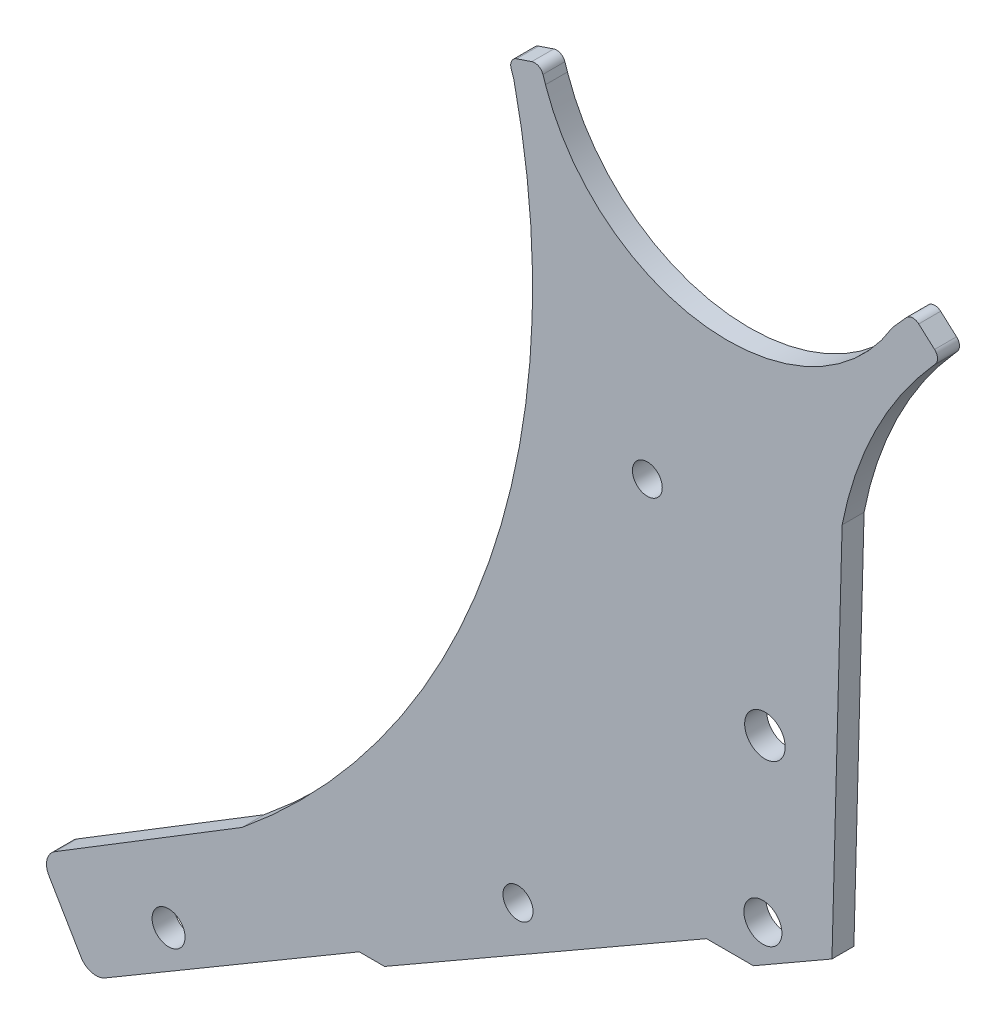
ISO-10303-21;
HEADER;
FILE_DESCRIPTION(('STEP AP214'),'2;1');
FILE_NAME('part.step','',(''),(''),'','','');
FILE_SCHEMA(('AUTOMOTIVE_DESIGN { 1 0 10303 214 1 1 1 1 }'));
ENDSEC;
DATA;
#1=APPLICATION_CONTEXT('core data for automotive mechanical design processes');
#2=APPLICATION_PROTOCOL_DEFINITION('international standard','automotive_design',2000,#1);
#3=PRODUCT_CONTEXT('',#1,'mechanical');
#4=PRODUCT('Part','Part','',(#3));
#5=PRODUCT_RELATED_PRODUCT_CATEGORY('part','',(#4));
#6=PRODUCT_DEFINITION_FORMATION('','',#4);
#7=PRODUCT_DEFINITION_CONTEXT('part definition',#1,'design');
#8=PRODUCT_DEFINITION('design','',#6,#7);
#9=PRODUCT_DEFINITION_SHAPE('','',#8);
#10=(LENGTH_UNIT() NAMED_UNIT(*) SI_UNIT(.MILLI.,.METRE.));
#11=(NAMED_UNIT(*) PLANE_ANGLE_UNIT() SI_UNIT($,.RADIAN.));
#12=(NAMED_UNIT(*) SI_UNIT($,.STERADIAN.) SOLID_ANGLE_UNIT());
#13=UNCERTAINTY_MEASURE_WITH_UNIT(LENGTH_MEASURE(1.E-05),#10,'distance_accuracy_value','');
#14=(GEOMETRIC_REPRESENTATION_CONTEXT(3) GLOBAL_UNCERTAINTY_ASSIGNED_CONTEXT((#13)) GLOBAL_UNIT_ASSIGNED_CONTEXT((#10,
#11,#12)) REPRESENTATION_CONTEXT('',''));
#15=CARTESIAN_POINT('',(0.,0.,0.));
#16=DIRECTION('',(0.,0.,1.));
#17=DIRECTION('',(1.,0.,0.));
#18=AXIS2_PLACEMENT_3D('',#15,#16,#17);
#19=CARTESIAN_POINT('',(3159.04794659915,4944.90162358502,25.));
#20=DIRECTION('',(0.,0.,-1.));
#21=DIRECTION('',(-1.,0.,0.));
#22=AXIS2_PLACEMENT_3D('',#19,#20,#21);
#23=PLANE('',#22);
#24=DIRECTION('',(0.867004066444502,0.49830106237966,0.));
#25=VECTOR('',#24,1.);
#26=CARTESIAN_POINT('',(2208.43093066674,4332.10493742993,25.));
#27=LINE('',#26,#25);
#28=CARTESIAN_POINT('',(2208.43093066674,4332.10493742993,25.));
#29=VERTEX_POINT('',#28);
#30=CARTESIAN_POINT('',(2574.93863669771,4542.75121505873,25.));
#31=VERTEX_POINT('',#30);
#32=EDGE_CURVE('E264',#29,#31,#27,.T.);
#33=ORIENTED_EDGE('',*,*,#32,.T.);
#34=DIRECTION('',(1.,0.,0.));
#35=VECTOR('',#34,1.);
#36=CARTESIAN_POINT('',(2574.93863669771,4542.75121505873,25.));
#37=LINE('',#36,#35);
#38=CARTESIAN_POINT('',(2628.39459834182,4542.75121505873,25.));
#39=VERTEX_POINT('',#38);
#40=EDGE_CURVE('E137',#31,#39,#37,.T.);
#41=ORIENTED_EDGE('',*,*,#40,.T.);
#42=DIRECTION('',(0.867004066444504,0.498301062379657,0.));
#43=VECTOR('',#42,1.);
#44=CARTESIAN_POINT('',(2628.39459834182,4542.75121505873,25.));
#45=LINE('',#44,#43);
#46=CARTESIAN_POINT('',(2717.83873943808,4594.15825253052,25.));
#47=VERTEX_POINT('',#46);
#48=EDGE_CURVE('E324',#39,#47,#45,.T.);
#49=ORIENTED_EDGE('',*,*,#48,.T.);
#50=DIRECTION('',(0.0267107411816373,0.99964320450125,0.));
#51=VECTOR('',#50,1.);
#52=CARTESIAN_POINT('',(2717.83873943808,4594.15825253052,25.));
#53=LINE('',#52,#51);
#54=CARTESIAN_POINT('',(2729.43156154605,5028.01689248414,25.));
#55=VERTEX_POINT('',#54);
#56=EDGE_CURVE('E343',#47,#55,#53,.T.);
#57=ORIENTED_EDGE('',*,*,#56,.T.);
#58=CARTESIAN_POINT('',(3159.04794659915,4944.90162358502,25.));
#59=DIRECTION('',(0.,0.,-1.));
#60=DIRECTION('',(-1.,0.,0.));
#61=AXIS2_PLACEMENT_3D('',#58,#59,#60);
#62=CIRCLE('',#61,437.582433639961);
#63=CARTESIAN_POINT('',(2832.53437686692,5236.2215079235,25.));
#64=VERTEX_POINT('',#63);
#65=EDGE_CURVE('E340',#55,#64,#62,.T.);
#66=ORIENTED_EDGE('',*,*,#65,.T.);
#67=DIRECTION('',(0.665748581164999,0.746176136496465,0.));
#68=VECTOR('',#67,1.);
#69=CARTESIAN_POINT('',(2832.53437686692,5236.2215079235,25.));
#70=LINE('',#69,#68);
#71=CARTESIAN_POINT('',(2835.47693860174,5239.51955377563,25.));
#72=VERTEX_POINT('',#71);
#73=EDGE_CURVE('E342',#64,#72,#70,.T.);
#74=ORIENTED_EDGE('',*,*,#73,.T.);
#75=CARTESIAN_POINT('',(2828.01517723675,5246.17703958726,25.));
#76=DIRECTION('',(0.,0.,1.));
#77=DIRECTION('',(1.,0.,0.));
#78=AXIS2_PLACEMENT_3D('',#75,#76,#77);
#79=CIRCLE('',#78,10.0000000000113);
#80=CARTESIAN_POINT('',(2834.67266304841,5253.63880095225,25.));
#81=VERTEX_POINT('',#80);
#82=EDGE_CURVE('E345',#72,#81,#79,.T.);
#83=ORIENTED_EDGE('',*,*,#82,.T.);
#84=DIRECTION('',(-0.746176136496549,0.665748581164904,0.));
#85=VECTOR('',#84,1.);
#86=CARTESIAN_POINT('',(2834.67266304841,5253.63880095225,25.));
#87=LINE('',#86,#85);
#88=CARTESIAN_POINT('',(2816.61377570219,5269.7511878809,25.));
#89=VERTEX_POINT('',#88);
#90=EDGE_CURVE('E351',#81,#89,#87,.T.);
#91=ORIENTED_EDGE('',*,*,#90,.T.);
#92=CARTESIAN_POINT('',(2809.95628989053,5262.28942651591,25.));
#93=DIRECTION('',(0.,0.,1.));
#94=DIRECTION('',(1.,0.,0.));
#95=AXIS2_PLACEMENT_3D('',#92,#93,#94);
#96=CIRCLE('',#95,10.0000000000235);
#97=CARTESIAN_POINT('',(2802.49452852558,5268.94691232759,25.));
#98=VERTEX_POINT('',#97);
#99=EDGE_CURVE('E353',#89,#98,#96,.T.);
#100=ORIENTED_EDGE('',*,*,#99,.T.);
#101=DIRECTION('',(-0.66574858116492,-0.746176136496535,0.));
#102=VECTOR('',#101,1.);
#103=CARTESIAN_POINT('',(2802.49452852558,5268.94691232759,25.));
#104=LINE('',#103,#102);
#105=CARTESIAN_POINT('',(2786.8013182789,5251.35784143449,25.));
#106=VERTEX_POINT('',#105);
#107=EDGE_CURVE('E355',#98,#106,#104,.T.);
#108=ORIENTED_EDGE('',*,*,#107,.T.);
#109=CARTESIAN_POINT('',(2598.8786965237,5363.26143505457,25.));
#110=DIRECTION('',(0.,0.,-1.));
#111=DIRECTION('',(-1.,0.,0.));
#112=AXIS2_PLACEMENT_3D('',#109,#110,#111);
#113=CIRCLE('',#112,218.717457082036);
#114=CARTESIAN_POINT('',(2391.6847836824,5293.20425473778,25.));
#115=VERTEX_POINT('',#114);
#116=EDGE_CURVE('E357',#106,#115,#113,.T.);
#117=ORIENTED_EDGE('',*,*,#116,.T.);
#118=DIRECTION('',(-0.320309047350232,0.94731310250919,0.));
#119=VECTOR('',#118,1.);
#120=CARTESIAN_POINT('',(2391.6847836824,5293.20425473778,25.));
#121=LINE('',#120,#119);
#122=CARTESIAN_POINT('',(2388.75367878607,5301.87298918688,25.));
#123=VERTEX_POINT('',#122);
#124=EDGE_CURVE('E359',#115,#123,#121,.T.);
#125=ORIENTED_EDGE('',*,*,#124,.T.);
#126=CARTESIAN_POINT('',(2379.28054776096,5298.66989871334,25.));
#127=DIRECTION('',(0.,0.,1.));
#128=DIRECTION('',(1.,0.,0.));
#129=AXIS2_PLACEMENT_3D('',#126,#127,#128);
#130=CIRCLE('',#129,10.0000000000312);
#131=CARTESIAN_POINT('',(2376.07745728748,5308.14302973847,25.));
#132=VERTEX_POINT('',#131);
#133=EDGE_CURVE('E361',#123,#132,#130,.T.);
#134=ORIENTED_EDGE('',*,*,#133,.T.);
#135=DIRECTION('',(-0.947313102509187,-0.32030904735024,0.));
#136=VECTOR('',#135,1.);
#137=CARTESIAN_POINT('',(2376.07745728748,5308.14302973847,25.));
#138=LINE('',#137,#136);
#139=CARTESIAN_POINT('',(2358.86126291214,5302.32182574078,25.));
#140=VERTEX_POINT('',#139);
#141=EDGE_CURVE('E363',#132,#140,#138,.T.);
#142=ORIENTED_EDGE('',*,*,#141,.T.);
#143=CARTESIAN_POINT('',(2362.06435338562,5292.84869471568,25.));
#144=DIRECTION('',(0.,0.,1.));
#145=DIRECTION('',(1.,0.,0.));
#146=AXIS2_PLACEMENT_3D('',#143,#144,#145);
#147=CIRCLE('',#146,10.0000000000024);
#148=CARTESIAN_POINT('',(2352.59122236054,5289.64560424222,25.));
#149=VERTEX_POINT('',#148);
#150=EDGE_CURVE('E365',#140,#149,#147,.T.);
#151=ORIENTED_EDGE('',*,*,#150,.T.);
#152=DIRECTION('',(0.320309047350246,-0.947313102509185,0.));
#153=VECTOR('',#152,1.);
#154=CARTESIAN_POINT('',(2352.59122236054,5289.64560424222,25.));
#155=LINE('',#154,#153);
#156=CARTESIAN_POINT('',(2355.52232725686,5280.97686979311,25.));
#157=VERTEX_POINT('',#156);
#158=EDGE_CURVE('E367',#149,#157,#155,.T.);
#159=ORIENTED_EDGE('',*,*,#158,.T.);
#160=CARTESIAN_POINT('',(1476.62059618426,5085.42901884207,25.));
#161=DIRECTION('',(0.,0.,-1.));
#162=DIRECTION('',(1.,0.,0.));
#163=AXIS2_PLACEMENT_3D('',#160,#161,#162);
#164=CIRCLE('',#163,900.392811440648);
#165=CARTESIAN_POINT('',(2046.19183959997,4388.07988564704,25.));
#166=VERTEX_POINT('',#165);
#167=EDGE_CURVE('E369',#157,#166,#164,.T.);
#168=ORIENTED_EDGE('',*,*,#167,.T.);
#169=DIRECTION('',(-0.852942357097446,-0.522005110577524,0.));
#170=VECTOR('',#169,1.);
#171=CARTESIAN_POINT('',(1833.10841997078,4257.67173660836,25.));
#172=LINE('',#171,#170);
#173=CARTESIAN_POINT('',(1833.10841997078,4257.67173660836,25.));
#174=VERTEX_POINT('',#173);
#175=EDGE_CURVE('E371',#166,#174,#172,.T.);
#176=ORIENTED_EDGE('',*,*,#175,.T.);
#177=CARTESIAN_POINT('',(1843.54852218233,4240.61288946641,25.));
#178=DIRECTION('',(0.,0.,1.));
#179=DIRECTION('',(-1.,0.,0.));
#180=AXIS2_PLACEMENT_3D('',#177,#178,#179);
#181=CIRCLE('',#180,20.0000000000001);
#182=CARTESIAN_POINT('',(1826.31583589167,4230.46229720745,25.));
#183=VERTEX_POINT('',#182);
#184=EDGE_CURVE('E373',#174,#183,#181,.T.);
#185=ORIENTED_EDGE('',*,*,#184,.T.);
#186=DIRECTION('',(0.507529612947959,-0.861634314533083,0.));
#187=VECTOR('',#186,1.);
#188=CARTESIAN_POINT('',(1862.71795105015,4168.6623337335,25.));
#189=LINE('',#188,#187);
#190=CARTESIAN_POINT('',(1862.71795105015,4168.6623337335,25.));
#191=VERTEX_POINT('',#190);
#192=EDGE_CURVE('E201',#183,#191,#189,.T.);
#193=ORIENTED_EDGE('',*,*,#192,.T.);
#194=CARTESIAN_POINT('',(1879.95063734081,4178.81292599246,25.));
#195=DIRECTION('',(0.,0.,1.));
#196=DIRECTION('',(1.,0.,0.));
#197=AXIS2_PLACEMENT_3D('',#194,#195,#196);
#198=CIRCLE('',#197,19.9999999999997);
#199=CARTESIAN_POINT('',(1890.10122959977,4161.58023970179,25.));
#200=VERTEX_POINT('',#199);
#201=EDGE_CURVE('E195',#191,#200,#198,.T.);
#202=ORIENTED_EDGE('',*,*,#201,.T.);
#203=DIRECTION('',(0.861634314533082,0.50752961294796,0.));
#204=VECTOR('',#203,1.);
#205=CARTESIAN_POINT('',(1890.10122959977,4161.58023970179,25.));
#206=LINE('',#205,#204);
#207=CARTESIAN_POINT('',(2179.6014425716,4332.10493742993,25.));
#208=VERTEX_POINT('',#207);
#209=EDGE_CURVE('E199',#200,#208,#206,.T.);
#210=ORIENTED_EDGE('',*,*,#209,.T.);
#211=DIRECTION('',(1.,0.,0.));
#212=VECTOR('',#211,1.);
#213=CARTESIAN_POINT('',(2179.6014425716,4332.10493742993,25.));
#214=LINE('',#213,#212);
#215=EDGE_CURVE('E49',#208,#29,#214,.T.);
#216=ORIENTED_EDGE('',*,*,#215,.T.);
#217=EDGE_LOOP('',(#33,#41,#49,#57,#66,#74,#83,#91,#100,#108,#117,#125,#134,#142,#151,#159,#168,
#176,#185,#193,#202,#210,#216));
#218=FACE_BOUND('',#217,.T.);
#219=CARTESIAN_POINT('',(1962.52950321667,4247.28244954385,25.));
#220=DIRECTION('',(0.,0.,1.));
#221=DIRECTION('',(1.,0.,0.));
#222=AXIS2_PLACEMENT_3D('',#219,#220,#221);
#223=CIRCLE('',#222,18.7853893391976);
#224=CARTESIAN_POINT('',(1981.31489255586,4247.28244954385,25.));
#225=VERTEX_POINT('',#224);
#226=EDGE_CURVE('E223',#225,#225,#223,.T.);
#227=ORIENTED_EDGE('',*,*,#226,.F.);
#228=EDGE_LOOP('',(#227));
#229=FACE_BOUND('',#228,.T.);
#230=CARTESIAN_POINT('',(2360.38808832887,4470.79330168986,25.));
#231=DIRECTION('',(0.,0.,1.));
#232=DIRECTION('',(1.,0.,0.));
#233=AXIS2_PLACEMENT_3D('',#230,#231,#232);
#234=CIRCLE('',#233,17.0932326128872);
#235=CARTESIAN_POINT('',(2377.48132094175,4470.79330168986,25.));
#236=VERTEX_POINT('',#235);
#237=EDGE_CURVE('E447',#236,#236,#234,.T.);
#238=ORIENTED_EDGE('',*,*,#237,.F.);
#239=EDGE_LOOP('',(#238));
#240=FACE_BOUND('',#239,.T.);
#241=CARTESIAN_POINT('',(2639.19466363185,4591.01574940001,25.));
#242=DIRECTION('',(0.,0.,1.));
#243=DIRECTION('',(1.,0.,0.));
#244=AXIS2_PLACEMENT_3D('',#241,#242,#243);
#245=CIRCLE('',#244,21.6482206468473);
#246=CARTESIAN_POINT('',(2660.8428842787,4591.01574940001,25.));
#247=VERTEX_POINT('',#246);
#248=EDGE_CURVE('E441',#247,#247,#245,.T.);
#249=ORIENTED_EDGE('',*,*,#248,.F.);
#250=EDGE_LOOP('',(#249));
#251=FACE_BOUND('',#250,.T.);
#252=CARTESIAN_POINT('',(2641.51524070192,4776.37987824989,25.));
#253=DIRECTION('',(0.,0.,1.));
#254=DIRECTION('',(1.,0.,0.));
#255=AXIS2_PLACEMENT_3D('',#252,#253,#254);
#256=CIRCLE('',#255,23.0850880798075);
#257=CARTESIAN_POINT('',(2664.60032878173,4776.37987824989,25.));
#258=VERTEX_POINT('',#257);
#259=EDGE_CURVE('E435',#258,#258,#256,.T.);
#260=ORIENTED_EDGE('',*,*,#259,.F.);
#261=EDGE_LOOP('',(#260));
#262=FACE_BOUND('',#261,.T.);
#263=CARTESIAN_POINT('',(2507.64090962262,4962.30334614338,25.));
#264=DIRECTION('',(0.,0.,1.));
#265=DIRECTION('',(1.,0.,0.));
#266=AXIS2_PLACEMENT_3D('',#263,#264,#265);
#267=CIRCLE('',#266,16.9907779611247);
#268=CARTESIAN_POINT('',(2524.63168758375,4962.30334614338,25.));
#269=VERTEX_POINT('',#268);
#270=EDGE_CURVE('E426',#269,#269,#267,.T.);
#271=ORIENTED_EDGE('',*,*,#270,.F.);
#272=EDGE_LOOP('',(#271));
#273=FACE_BOUND('',#272,.T.);
#274=ADVANCED_FACE('F32',(#218,#229,#240,#251,#262,#273),#23,.F.);
#275=CARTESIAN_POINT('',(3159.04794659915,4944.90162358502,0.));
#276=DIRECTION('',(0.,0.,-1.));
#277=DIRECTION('',(-1.,0.,0.));
#278=AXIS2_PLACEMENT_3D('',#275,#276,#277);
#279=PLANE('',#278);
#280=CARTESIAN_POINT('',(2641.51524070192,4776.37987824989,0.));
#281=DIRECTION('',(0.,0.,1.));
#282=DIRECTION('',(1.,0.,0.));
#283=AXIS2_PLACEMENT_3D('',#280,#281,#282);
#284=CIRCLE('',#283,23.0850880798075);
#285=CARTESIAN_POINT('',(2664.60032878173,4776.37987824989,0.));
#286=VERTEX_POINT('',#285);
#287=EDGE_CURVE('E432',#286,#286,#284,.T.);
#288=ORIENTED_EDGE('',*,*,#287,.T.);
#289=EDGE_LOOP('',(#288));
#290=FACE_BOUND('',#289,.T.);
#291=CARTESIAN_POINT('',(2360.38808832887,4470.79330168986,0.));
#292=DIRECTION('',(0.,0.,1.));
#293=DIRECTION('',(1.,0.,0.));
#294=AXIS2_PLACEMENT_3D('',#291,#292,#293);
#295=CIRCLE('',#294,17.0932326128872);
#296=CARTESIAN_POINT('',(2377.48132094175,4470.79330168986,0.));
#297=VERTEX_POINT('',#296);
#298=EDGE_CURVE('E444',#297,#297,#295,.T.);
#299=ORIENTED_EDGE('',*,*,#298,.T.);
#300=EDGE_LOOP('',(#299));
#301=FACE_BOUND('',#300,.T.);
#302=DIRECTION('',(0.867004066444502,0.49830106237966,0.));
#303=VECTOR('',#302,1.);
#304=CARTESIAN_POINT('',(2208.43093066674,4332.10493742993,0.));
#305=LINE('',#304,#303);
#306=CARTESIAN_POINT('',(2208.43093066674,4332.10493742993,0.));
#307=VERTEX_POINT('',#306);
#308=CARTESIAN_POINT('',(2574.93863669771,4542.75121505873,0.));
#309=VERTEX_POINT('',#308);
#310=EDGE_CURVE('E219',#307,#309,#305,.T.);
#311=ORIENTED_EDGE('',*,*,#310,.F.);
#312=DIRECTION('',(1.,0.,0.));
#313=VECTOR('',#312,1.);
#314=CARTESIAN_POINT('',(2179.6014425716,4332.10493742993,0.));
#315=LINE('',#314,#313);
#316=CARTESIAN_POINT('',(2179.6014425716,4332.10493742993,0.));
#317=VERTEX_POINT('',#316);
#318=EDGE_CURVE('E129',#317,#307,#315,.T.);
#319=ORIENTED_EDGE('',*,*,#318,.F.);
#320=DIRECTION('',(0.861634314533082,0.50752961294796,0.));
#321=VECTOR('',#320,1.);
#322=CARTESIAN_POINT('',(1890.10122959977,4161.58023970179,0.));
#323=LINE('',#322,#321);
#324=CARTESIAN_POINT('',(1890.10122959977,4161.58023970179,0.));
#325=VERTEX_POINT('',#324);
#326=EDGE_CURVE('E123',#325,#317,#323,.T.);
#327=ORIENTED_EDGE('',*,*,#326,.F.);
#328=CARTESIAN_POINT('',(1879.95063734081,4178.81292599246,0.));
#329=DIRECTION('',(0.,0.,1.));
#330=DIRECTION('',(1.,0.,0.));
#331=AXIS2_PLACEMENT_3D('',#328,#329,#330);
#332=CIRCLE('',#331,19.9999999999997);
#333=CARTESIAN_POINT('',(1862.71795105015,4168.6623337335,0.));
#334=VERTEX_POINT('',#333);
#335=EDGE_CURVE('E209',#334,#325,#332,.T.);
#336=ORIENTED_EDGE('',*,*,#335,.F.);
#337=DIRECTION('',(0.507529612947959,-0.861634314533083,0.));
#338=VECTOR('',#337,1.);
#339=CARTESIAN_POINT('',(1862.71795105015,4168.6623337335,0.));
#340=LINE('',#339,#338);
#341=CARTESIAN_POINT('',(1826.31583589167,4230.46229720745,0.));
#342=VERTEX_POINT('',#341);
#343=EDGE_CURVE('E259',#342,#334,#340,.T.);
#344=ORIENTED_EDGE('',*,*,#343,.F.);
#345=CARTESIAN_POINT('',(1843.54852218233,4240.61288946641,0.));
#346=DIRECTION('',(0.,0.,1.));
#347=DIRECTION('',(-1.,0.,0.));
#348=AXIS2_PLACEMENT_3D('',#345,#346,#347);
#349=CIRCLE('',#348,20.0000000000001);
#350=CARTESIAN_POINT('',(1833.10841997078,4257.67173660836,0.));
#351=VERTEX_POINT('',#350);
#352=EDGE_CURVE('E257',#351,#342,#349,.T.);
#353=ORIENTED_EDGE('',*,*,#352,.F.);
#354=DIRECTION('',(-0.852942357097446,-0.522005110577524,0.));
#355=VECTOR('',#354,1.);
#356=CARTESIAN_POINT('',(1833.10841997078,4257.67173660836,0.));
#357=LINE('',#356,#355);
#358=CARTESIAN_POINT('',(2046.19183959997,4388.07988564704,0.));
#359=VERTEX_POINT('',#358);
#360=EDGE_CURVE('E255',#359,#351,#357,.T.);
#361=ORIENTED_EDGE('',*,*,#360,.F.);
#362=CARTESIAN_POINT('',(1476.62059618426,5085.42901884207,0.));
#363=DIRECTION('',(0.,0.,-1.));
#364=DIRECTION('',(1.,0.,0.));
#365=AXIS2_PLACEMENT_3D('',#362,#363,#364);
#366=CIRCLE('',#365,900.392811440648);
#367=CARTESIAN_POINT('',(2355.52232725686,5280.97686979311,0.));
#368=VERTEX_POINT('',#367);
#369=EDGE_CURVE('E253',#368,#359,#366,.T.);
#370=ORIENTED_EDGE('',*,*,#369,.F.);
#371=DIRECTION('',(0.320309047350246,-0.947313102509185,0.));
#372=VECTOR('',#371,1.);
#373=CARTESIAN_POINT('',(2352.59122236054,5289.64560424222,0.));
#374=LINE('',#373,#372);
#375=CARTESIAN_POINT('',(2352.59122236054,5289.64560424222,0.));
#376=VERTEX_POINT('',#375);
#377=EDGE_CURVE('E251',#376,#368,#374,.T.);
#378=ORIENTED_EDGE('',*,*,#377,.F.);
#379=CARTESIAN_POINT('',(2362.06435338562,5292.84869471568,0.));
#380=DIRECTION('',(0.,0.,1.));
#381=DIRECTION('',(1.,0.,0.));
#382=AXIS2_PLACEMENT_3D('',#379,#380,#381);
#383=CIRCLE('',#382,10.0000000000024);
#384=CARTESIAN_POINT('',(2358.86126291214,5302.32182574078,0.));
#385=VERTEX_POINT('',#384);
#386=EDGE_CURVE('E249',#385,#376,#383,.T.);
#387=ORIENTED_EDGE('',*,*,#386,.F.);
#388=DIRECTION('',(-0.947313102509187,-0.32030904735024,0.));
#389=VECTOR('',#388,1.);
#390=CARTESIAN_POINT('',(2376.07745728748,5308.14302973847,0.));
#391=LINE('',#390,#389);
#392=CARTESIAN_POINT('',(2376.07745728748,5308.14302973847,0.));
#393=VERTEX_POINT('',#392);
#394=EDGE_CURVE('E247',#393,#385,#391,.T.);
#395=ORIENTED_EDGE('',*,*,#394,.F.);
#396=CARTESIAN_POINT('',(2379.28054776096,5298.66989871334,0.));
#397=DIRECTION('',(0.,0.,1.));
#398=DIRECTION('',(1.,0.,0.));
#399=AXIS2_PLACEMENT_3D('',#396,#397,#398);
#400=CIRCLE('',#399,10.0000000000312);
#401=CARTESIAN_POINT('',(2388.75367878607,5301.87298918688,0.));
#402=VERTEX_POINT('',#401);
#403=EDGE_CURVE('E245',#402,#393,#400,.T.);
#404=ORIENTED_EDGE('',*,*,#403,.F.);
#405=DIRECTION('',(-0.320309047350232,0.94731310250919,0.));
#406=VECTOR('',#405,1.);
#407=CARTESIAN_POINT('',(2391.6847836824,5293.20425473778,0.));
#408=LINE('',#407,#406);
#409=CARTESIAN_POINT('',(2391.6847836824,5293.20425473778,0.));
#410=VERTEX_POINT('',#409);
#411=EDGE_CURVE('E243',#410,#402,#408,.T.);
#412=ORIENTED_EDGE('',*,*,#411,.F.);
#413=CARTESIAN_POINT('',(2598.8786965237,5363.26143505457,0.));
#414=DIRECTION('',(0.,0.,-1.));
#415=DIRECTION('',(-1.,0.,0.));
#416=AXIS2_PLACEMENT_3D('',#413,#414,#415);
#417=CIRCLE('',#416,218.717457082036);
#418=CARTESIAN_POINT('',(2786.8013182789,5251.35784143449,0.));
#419=VERTEX_POINT('',#418);
#420=EDGE_CURVE('E241',#419,#410,#417,.T.);
#421=ORIENTED_EDGE('',*,*,#420,.F.);
#422=DIRECTION('',(-0.66574858116492,-0.746176136496535,0.));
#423=VECTOR('',#422,1.);
#424=CARTESIAN_POINT('',(2802.49452852558,5268.94691232759,0.));
#425=LINE('',#424,#423);
#426=CARTESIAN_POINT('',(2802.49452852558,5268.94691232759,0.));
#427=VERTEX_POINT('',#426);
#428=EDGE_CURVE('E239',#427,#419,#425,.T.);
#429=ORIENTED_EDGE('',*,*,#428,.F.);
#430=CARTESIAN_POINT('',(2809.95628989053,5262.28942651591,0.));
#431=DIRECTION('',(0.,0.,1.));
#432=DIRECTION('',(1.,0.,0.));
#433=AXIS2_PLACEMENT_3D('',#430,#431,#432);
#434=CIRCLE('',#433,10.0000000000235);
#435=CARTESIAN_POINT('',(2816.61377570219,5269.7511878809,0.));
#436=VERTEX_POINT('',#435);
#437=EDGE_CURVE('E237',#436,#427,#434,.T.);
#438=ORIENTED_EDGE('',*,*,#437,.F.);
#439=DIRECTION('',(-0.746176136496549,0.665748581164904,0.));
#440=VECTOR('',#439,1.);
#441=CARTESIAN_POINT('',(2834.67266304841,5253.63880095225,0.));
#442=LINE('',#441,#440);
#443=CARTESIAN_POINT('',(2834.67266304841,5253.63880095225,0.));
#444=VERTEX_POINT('',#443);
#445=EDGE_CURVE('E235',#444,#436,#442,.T.);
#446=ORIENTED_EDGE('',*,*,#445,.F.);
#447=CARTESIAN_POINT('',(2828.01517723675,5246.17703958726,0.));
#448=DIRECTION('',(0.,0.,1.));
#449=DIRECTION('',(1.,0.,0.));
#450=AXIS2_PLACEMENT_3D('',#447,#448,#449);
#451=CIRCLE('',#450,10.0000000000113);
#452=CARTESIAN_POINT('',(2835.47693860174,5239.51955377563,0.));
#453=VERTEX_POINT('',#452);
#454=EDGE_CURVE('E233',#453,#444,#451,.T.);
#455=ORIENTED_EDGE('',*,*,#454,.F.);
#456=DIRECTION('',(0.665748581164999,0.746176136496465,0.));
#457=VECTOR('',#456,1.);
#458=CARTESIAN_POINT('',(2832.53437686692,5236.2215079235,0.));
#459=LINE('',#458,#457);
#460=CARTESIAN_POINT('',(2832.53437686692,5236.2215079235,0.));
#461=VERTEX_POINT('',#460);
#462=EDGE_CURVE('E231',#461,#453,#459,.T.);
#463=ORIENTED_EDGE('',*,*,#462,.F.);
#464=CARTESIAN_POINT('',(3159.04794659915,4944.90162358502,0.));
#465=DIRECTION('',(0.,0.,-1.));
#466=DIRECTION('',(-1.,0.,0.));
#467=AXIS2_PLACEMENT_3D('',#464,#465,#466);
#468=CIRCLE('',#467,437.582433639961);
#469=CARTESIAN_POINT('',(2729.43156154605,5028.01689248414,0.));
#470=VERTEX_POINT('',#469);
#471=EDGE_CURVE('E229',#470,#461,#468,.T.);
#472=ORIENTED_EDGE('',*,*,#471,.F.);
#473=DIRECTION('',(0.0267107411816373,0.99964320450125,0.));
#474=VECTOR('',#473,1.);
#475=CARTESIAN_POINT('',(2717.83873943808,4594.15825253052,0.));
#476=LINE('',#475,#474);
#477=CARTESIAN_POINT('',(2717.83873943808,4594.15825253052,0.));
#478=VERTEX_POINT('',#477);
#479=EDGE_CURVE('E227',#478,#470,#476,.T.);
#480=ORIENTED_EDGE('',*,*,#479,.F.);
#481=DIRECTION('',(0.867004066444504,0.498301062379657,0.));
#482=VECTOR('',#481,1.);
#483=CARTESIAN_POINT('',(2628.39459834182,4542.75121505873,0.));
#484=LINE('',#483,#482);
#485=CARTESIAN_POINT('',(2628.39459834182,4542.75121505873,0.));
#486=VERTEX_POINT('',#485);
#487=EDGE_CURVE('E225',#486,#478,#484,.T.);
#488=ORIENTED_EDGE('',*,*,#487,.F.);
#489=DIRECTION('',(1.,0.,0.));
#490=VECTOR('',#489,1.);
#491=CARTESIAN_POINT('',(2574.93863669771,4542.75121505873,0.));
#492=LINE('',#491,#490);
#493=EDGE_CURVE('E222',#309,#486,#492,.T.);
#494=ORIENTED_EDGE('',*,*,#493,.F.);
#495=EDGE_LOOP('',(#311,#319,#327,#336,#344,#353,#361,#370,#378,#387,#395,#404,#412,#421,#429,
#438,#446,#455,#463,#472,#480,#488,#494));
#496=FACE_BOUND('',#495,.T.);
#497=CARTESIAN_POINT('',(1962.52950321667,4247.28244954385,0.));
#498=DIRECTION('',(0.,0.,1.));
#499=DIRECTION('',(1.,0.,0.));
#500=AXIS2_PLACEMENT_3D('',#497,#498,#499);
#501=CIRCLE('',#500,18.7853893391976);
#502=CARTESIAN_POINT('',(1981.31489255586,4247.28244954385,0.));
#503=VERTEX_POINT('',#502);
#504=EDGE_CURVE('E450',#503,#503,#501,.T.);
#505=ORIENTED_EDGE('',*,*,#504,.T.);
#506=EDGE_LOOP('',(#505));
#507=FACE_BOUND('',#506,.T.);
#508=CARTESIAN_POINT('',(2639.19466363185,4591.01574940001,0.));
#509=DIRECTION('',(0.,0.,1.));
#510=DIRECTION('',(1.,0.,0.));
#511=AXIS2_PLACEMENT_3D('',#508,#509,#510);
#512=CIRCLE('',#511,21.6482206468473);
#513=CARTESIAN_POINT('',(2660.8428842787,4591.01574940001,0.));
#514=VERTEX_POINT('',#513);
#515=EDGE_CURVE('E438',#514,#514,#512,.T.);
#516=ORIENTED_EDGE('',*,*,#515,.T.);
#517=EDGE_LOOP('',(#516));
#518=FACE_BOUND('',#517,.T.);
#519=CARTESIAN_POINT('',(2507.64090962262,4962.30334614338,0.));
#520=DIRECTION('',(0.,0.,1.));
#521=DIRECTION('',(1.,0.,0.));
#522=AXIS2_PLACEMENT_3D('',#519,#520,#521);
#523=CIRCLE('',#522,16.9907779611247);
#524=CARTESIAN_POINT('',(2524.63168758375,4962.30334614338,0.));
#525=VERTEX_POINT('',#524);
#526=EDGE_CURVE('E429',#525,#525,#523,.T.);
#527=ORIENTED_EDGE('',*,*,#526,.T.);
#528=EDGE_LOOP('',(#527));
#529=FACE_BOUND('',#528,.T.);
#530=ADVANCED_FACE('F328',(#290,#301,#496,#507,#518,#529),#279,.T.);
#531=CARTESIAN_POINT('',(2208.43093066674,4332.10493742993,25.));
#532=DIRECTION('',(-0.49830106237966,0.867004066444502,0.));
#533=DIRECTION('',(-0.867004066444502,-0.49830106237966,0.));
#534=AXIS2_PLACEMENT_3D('',#531,#532,#533);
#535=PLANE('',#534);
#536=ORIENTED_EDGE('',*,*,#310,.T.);
#537=DIRECTION('',(0.,0.,-1.));
#538=VECTOR('',#537,1.);
#539=CARTESIAN_POINT('',(2574.93863669771,4542.75121505873,25.));
#540=LINE('',#539,#538);
#541=EDGE_CURVE('E11',#31,#309,#540,.T.);
#542=ORIENTED_EDGE('',*,*,#541,.F.);
#543=ORIENTED_EDGE('',*,*,#32,.F.);
#544=DIRECTION('',(0.,0.,-1.));
#545=VECTOR('',#544,1.);
#546=CARTESIAN_POINT('',(2208.43093066674,4332.10493742993,25.));
#547=LINE('',#546,#545);
#548=EDGE_CURVE('E215',#29,#307,#547,.T.);
#549=ORIENTED_EDGE('',*,*,#548,.T.);
#550=EDGE_LOOP('',(#536,#542,#543,#549));
#551=FACE_BOUND('',#550,.T.);
#552=ADVANCED_FACE('F34',(#551),#535,.F.);
#553=CARTESIAN_POINT('',(2574.93863669771,4542.75121505873,25.));
#554=DIRECTION('',(0.,1.,0.));
#555=DIRECTION('',(0.,0.,1.));
#556=AXIS2_PLACEMENT_3D('',#553,#554,#555);
#557=PLANE('',#556);
#558=ORIENTED_EDGE('',*,*,#493,.T.);
#559=DIRECTION('',(0.,0.,-1.));
#560=VECTOR('',#559,1.);
#561=CARTESIAN_POINT('',(2628.39459834182,4542.75121505873,25.));
#562=LINE('',#561,#560);
#563=EDGE_CURVE('E41',#39,#486,#562,.T.);
#564=ORIENTED_EDGE('',*,*,#563,.F.);
#565=ORIENTED_EDGE('',*,*,#40,.F.);
#566=ORIENTED_EDGE('',*,*,#541,.T.);
#567=EDGE_LOOP('',(#558,#564,#565,#566));
#568=FACE_BOUND('',#567,.T.);
#569=ADVANCED_FACE('F687',(#568),#557,.F.);
#570=CARTESIAN_POINT('',(2628.39459834182,4542.75121505873,25.));
#571=DIRECTION('',(-0.498301062379657,0.867004066444504,0.));
#572=DIRECTION('',(-0.867004066444504,-0.498301062379657,0.));
#573=AXIS2_PLACEMENT_3D('',#570,#571,#572);
#574=PLANE('',#573);
#575=ORIENTED_EDGE('',*,*,#487,.T.);
#576=DIRECTION('',(0.,0.,-1.));
#577=VECTOR('',#576,1.);
#578=CARTESIAN_POINT('',(2717.83873943808,4594.15825253052,25.));
#579=LINE('',#578,#577);
#580=EDGE_CURVE('E316',#47,#478,#579,.T.);
#581=ORIENTED_EDGE('',*,*,#580,.F.);
#582=ORIENTED_EDGE('',*,*,#48,.F.);
#583=ORIENTED_EDGE('',*,*,#563,.T.);
#584=EDGE_LOOP('',(#575,#581,#582,#583));
#585=FACE_BOUND('',#584,.T.);
#586=ADVANCED_FACE('F322',(#585),#574,.F.);
#587=CARTESIAN_POINT('',(2717.83873943808,4594.15825253052,25.));
#588=DIRECTION('',(-0.99964320450125,0.0267107411816373,0.));
#589=DIRECTION('',(-0.0267107411816373,-0.99964320450125,0.));
#590=AXIS2_PLACEMENT_3D('',#587,#588,#589);
#591=PLANE('',#590);
#592=ORIENTED_EDGE('',*,*,#479,.T.);
#593=DIRECTION('',(0.,0.,-1.));
#594=VECTOR('',#593,1.);
#595=CARTESIAN_POINT('',(2729.43156154605,5028.01689248414,25.));
#596=LINE('',#595,#594);
#597=EDGE_CURVE('E313',#55,#470,#596,.T.);
#598=ORIENTED_EDGE('',*,*,#597,.F.);
#599=ORIENTED_EDGE('',*,*,#56,.F.);
#600=ORIENTED_EDGE('',*,*,#580,.T.);
#601=EDGE_LOOP('',(#592,#598,#599,#600));
#602=FACE_BOUND('',#601,.T.);
#603=ADVANCED_FACE('F334',(#602),#591,.F.);
#604=CARTESIAN_POINT('',(3159.04794659915,4944.90162358502,25.));
#605=DIRECTION('',(0.,0.,-1.));
#606=DIRECTION('',(-1.,0.,0.));
#607=AXIS2_PLACEMENT_3D('',#604,#605,#606);
#608=CYLINDRICAL_SURFACE('',#607,437.582433639961);
#609=ORIENTED_EDGE('',*,*,#471,.T.);
#610=DIRECTION('',(0.,0.,-1.));
#611=VECTOR('',#610,1.);
#612=CARTESIAN_POINT('',(2832.53437686692,5236.2215079235,25.));
#613=LINE('',#612,#611);
#614=EDGE_CURVE('E310',#64,#461,#613,.T.);
#615=ORIENTED_EDGE('',*,*,#614,.F.);
#616=ORIENTED_EDGE('',*,*,#65,.F.);
#617=ORIENTED_EDGE('',*,*,#597,.T.);
#618=EDGE_LOOP('',(#609,#615,#616,#617));
#619=FACE_BOUND('',#618,.T.);
#620=ADVANCED_FACE('F338',(#619),#608,.F.);
#621=CARTESIAN_POINT('',(2832.53437686692,5236.2215079235,25.));
#622=DIRECTION('',(-0.746176136496465,0.665748581164999,0.));
#623=DIRECTION('',(-0.665748581164999,-0.746176136496465,0.));
#624=AXIS2_PLACEMENT_3D('',#621,#622,#623);
#625=PLANE('',#624);
#626=ORIENTED_EDGE('',*,*,#462,.T.);
#627=DIRECTION('',(0.,0.,-1.));
#628=VECTOR('',#627,1.);
#629=CARTESIAN_POINT('',(2835.47693860174,5239.51955377563,25.));
#630=LINE('',#629,#628);
#631=EDGE_CURVE('E307',#72,#453,#630,.T.);
#632=ORIENTED_EDGE('',*,*,#631,.F.);
#633=ORIENTED_EDGE('',*,*,#73,.F.);
#634=ORIENTED_EDGE('',*,*,#614,.T.);
#635=EDGE_LOOP('',(#626,#632,#633,#634));
#636=FACE_BOUND('',#635,.T.);
#637=ADVANCED_FACE('F652',(#636),#625,.F.);
#638=CARTESIAN_POINT('',(2828.01517723675,5246.17703958726,25.));
#639=DIRECTION('',(0.,0.,-1.));
#640=DIRECTION('',(-1.,0.,0.));
#641=AXIS2_PLACEMENT_3D('',#638,#639,#640);
#642=CYLINDRICAL_SURFACE('',#641,10.0000000000113);
#643=ORIENTED_EDGE('',*,*,#454,.T.);
#644=DIRECTION('',(0.,0.,-1.));
#645=VECTOR('',#644,1.);
#646=CARTESIAN_POINT('',(2834.67266304841,5253.63880095225,25.));
#647=LINE('',#646,#645);
#648=EDGE_CURVE('E304',#81,#444,#647,.T.);
#649=ORIENTED_EDGE('',*,*,#648,.F.);
#650=ORIENTED_EDGE('',*,*,#82,.F.);
#651=ORIENTED_EDGE('',*,*,#631,.T.);
#652=EDGE_LOOP('',(#643,#649,#650,#651));
#653=FACE_BOUND('',#652,.T.);
#654=ADVANCED_FACE('F642',(#653),#642,.T.);
#655=CARTESIAN_POINT('',(2834.67266304841,5253.63880095225,25.));
#656=DIRECTION('',(-0.665748581164904,-0.746176136496549,0.));
#657=DIRECTION('',(0.746176136496549,-0.665748581164904,0.));
#658=AXIS2_PLACEMENT_3D('',#655,#656,#657);
#659=PLANE('',#658);
#660=ORIENTED_EDGE('',*,*,#445,.T.);
#661=DIRECTION('',(0.,0.,-1.));
#662=VECTOR('',#661,1.);
#663=CARTESIAN_POINT('',(2816.61377570219,5269.7511878809,25.));
#664=LINE('',#663,#662);
#665=EDGE_CURVE('E301',#89,#436,#664,.T.);
#666=ORIENTED_EDGE('',*,*,#665,.F.);
#667=ORIENTED_EDGE('',*,*,#90,.F.);
#668=ORIENTED_EDGE('',*,*,#648,.T.);
#669=EDGE_LOOP('',(#660,#666,#667,#668));
#670=FACE_BOUND('',#669,.T.);
#671=ADVANCED_FACE('F632',(#670),#659,.F.);
#672=CARTESIAN_POINT('',(2809.95628989053,5262.28942651591,25.));
#673=DIRECTION('',(0.,0.,-1.));
#674=DIRECTION('',(-1.,0.,0.));
#675=AXIS2_PLACEMENT_3D('',#672,#673,#674);
#676=CYLINDRICAL_SURFACE('',#675,10.0000000000235);
#677=ORIENTED_EDGE('',*,*,#437,.T.);
#678=DIRECTION('',(0.,0.,-1.));
#679=VECTOR('',#678,1.);
#680=CARTESIAN_POINT('',(2802.49452852558,5268.94691232759,25.));
#681=LINE('',#680,#679);
#682=EDGE_CURVE('E298',#98,#427,#681,.T.);
#683=ORIENTED_EDGE('',*,*,#682,.F.);
#684=ORIENTED_EDGE('',*,*,#99,.F.);
#685=ORIENTED_EDGE('',*,*,#665,.T.);
#686=EDGE_LOOP('',(#677,#683,#684,#685));
#687=FACE_BOUND('',#686,.T.);
#688=ADVANCED_FACE('F622',(#687),#676,.T.);
#689=CARTESIAN_POINT('',(2802.49452852558,5268.94691232759,25.));
#690=DIRECTION('',(0.746176136496535,-0.66574858116492,0.));
#691=DIRECTION('',(0.66574858116492,0.746176136496535,0.));
#692=AXIS2_PLACEMENT_3D('',#689,#690,#691);
#693=PLANE('',#692);
#694=ORIENTED_EDGE('',*,*,#428,.T.);
#695=DIRECTION('',(0.,0.,-1.));
#696=VECTOR('',#695,1.);
#697=CARTESIAN_POINT('',(2786.8013182789,5251.35784143449,25.));
#698=LINE('',#697,#696);
#699=EDGE_CURVE('E295',#106,#419,#698,.T.);
#700=ORIENTED_EDGE('',*,*,#699,.F.);
#701=ORIENTED_EDGE('',*,*,#107,.F.);
#702=ORIENTED_EDGE('',*,*,#682,.T.);
#703=EDGE_LOOP('',(#694,#700,#701,#702));
#704=FACE_BOUND('',#703,.T.);
#705=ADVANCED_FACE('F612',(#704),#693,.F.);
#706=CARTESIAN_POINT('',(2598.8786965237,5363.26143505457,25.));
#707=DIRECTION('',(0.,0.,-1.));
#708=DIRECTION('',(-1.,0.,0.));
#709=AXIS2_PLACEMENT_3D('',#706,#707,#708);
#710=CYLINDRICAL_SURFACE('',#709,218.717457082036);
#711=ORIENTED_EDGE('',*,*,#420,.T.);
#712=DIRECTION('',(0.,0.,-1.));
#713=VECTOR('',#712,1.);
#714=CARTESIAN_POINT('',(2391.6847836824,5293.20425473778,25.));
#715=LINE('',#714,#713);
#716=EDGE_CURVE('E292',#115,#410,#715,.T.);
#717=ORIENTED_EDGE('',*,*,#716,.F.);
#718=ORIENTED_EDGE('',*,*,#116,.F.);
#719=ORIENTED_EDGE('',*,*,#699,.T.);
#720=EDGE_LOOP('',(#711,#717,#718,#719));
#721=FACE_BOUND('',#720,.T.);
#722=ADVANCED_FACE('F602',(#721),#710,.F.);
#723=CARTESIAN_POINT('',(2391.6847836824,5293.20425473778,25.));
#724=DIRECTION('',(-0.94731310250919,-0.320309047350232,0.));
#725=DIRECTION('',(0.320309047350232,-0.94731310250919,0.));
#726=AXIS2_PLACEMENT_3D('',#723,#724,#725);
#727=PLANE('',#726);
#728=ORIENTED_EDGE('',*,*,#411,.T.);
#729=DIRECTION('',(0.,0.,-1.));
#730=VECTOR('',#729,1.);
#731=CARTESIAN_POINT('',(2388.75367878607,5301.87298918688,25.));
#732=LINE('',#731,#730);
#733=EDGE_CURVE('E289',#123,#402,#732,.T.);
#734=ORIENTED_EDGE('',*,*,#733,.F.);
#735=ORIENTED_EDGE('',*,*,#124,.F.);
#736=ORIENTED_EDGE('',*,*,#716,.T.);
#737=EDGE_LOOP('',(#728,#734,#735,#736));
#738=FACE_BOUND('',#737,.T.);
#739=ADVANCED_FACE('F592',(#738),#727,.F.);
#740=CARTESIAN_POINT('',(2379.28054776096,5298.66989871334,25.));
#741=DIRECTION('',(0.,0.,-1.));
#742=DIRECTION('',(-1.,0.,0.));
#743=AXIS2_PLACEMENT_3D('',#740,#741,#742);
#744=CYLINDRICAL_SURFACE('',#743,10.0000000000312);
#745=ORIENTED_EDGE('',*,*,#403,.T.);
#746=DIRECTION('',(0.,0.,-1.));
#747=VECTOR('',#746,1.);
#748=CARTESIAN_POINT('',(2376.07745728748,5308.14302973847,25.));
#749=LINE('',#748,#747);
#750=EDGE_CURVE('E286',#132,#393,#749,.T.);
#751=ORIENTED_EDGE('',*,*,#750,.F.);
#752=ORIENTED_EDGE('',*,*,#133,.F.);
#753=ORIENTED_EDGE('',*,*,#733,.T.);
#754=EDGE_LOOP('',(#745,#751,#752,#753));
#755=FACE_BOUND('',#754,.T.);
#756=ADVANCED_FACE('F582',(#755),#744,.T.);
#757=CARTESIAN_POINT('',(2376.07745728748,5308.14302973847,25.));
#758=DIRECTION('',(0.32030904735024,-0.947313102509187,0.));
#759=DIRECTION('',(0.947313102509187,0.32030904735024,0.));
#760=AXIS2_PLACEMENT_3D('',#757,#758,#759);
#761=PLANE('',#760);
#762=ORIENTED_EDGE('',*,*,#394,.T.);
#763=DIRECTION('',(0.,0.,-1.));
#764=VECTOR('',#763,1.);
#765=CARTESIAN_POINT('',(2358.86126291214,5302.32182574078,25.));
#766=LINE('',#765,#764);
#767=EDGE_CURVE('E283',#140,#385,#766,.T.);
#768=ORIENTED_EDGE('',*,*,#767,.F.);
#769=ORIENTED_EDGE('',*,*,#141,.F.);
#770=ORIENTED_EDGE('',*,*,#750,.T.);
#771=EDGE_LOOP('',(#762,#768,#769,#770));
#772=FACE_BOUND('',#771,.T.);
#773=ADVANCED_FACE('F572',(#772),#761,.F.);
#774=CARTESIAN_POINT('',(2362.06435338562,5292.84869471568,25.));
#775=DIRECTION('',(0.,0.,-1.));
#776=DIRECTION('',(-1.,0.,0.));
#777=AXIS2_PLACEMENT_3D('',#774,#775,#776);
#778=CYLINDRICAL_SURFACE('',#777,10.0000000000024);
#779=ORIENTED_EDGE('',*,*,#386,.T.);
#780=DIRECTION('',(0.,0.,-1.));
#781=VECTOR('',#780,1.);
#782=CARTESIAN_POINT('',(2352.59122236054,5289.64560424222,25.));
#783=LINE('',#782,#781);
#784=EDGE_CURVE('E280',#149,#376,#783,.T.);
#785=ORIENTED_EDGE('',*,*,#784,.F.);
#786=ORIENTED_EDGE('',*,*,#150,.F.);
#787=ORIENTED_EDGE('',*,*,#767,.T.);
#788=EDGE_LOOP('',(#779,#785,#786,#787));
#789=FACE_BOUND('',#788,.T.);
#790=ADVANCED_FACE('F562',(#789),#778,.T.);
#791=CARTESIAN_POINT('',(2352.59122236054,5289.64560424222,25.));
#792=DIRECTION('',(0.947313102509185,0.320309047350246,0.));
#793=DIRECTION('',(-0.320309047350246,0.947313102509185,0.));
#794=AXIS2_PLACEMENT_3D('',#791,#792,#793);
#795=PLANE('',#794);
#796=ORIENTED_EDGE('',*,*,#377,.T.);
#797=DIRECTION('',(0.,0.,-1.));
#798=VECTOR('',#797,1.);
#799=CARTESIAN_POINT('',(2355.52232725686,5280.97686979311,25.));
#800=LINE('',#799,#798);
#801=EDGE_CURVE('E277',#157,#368,#800,.T.);
#802=ORIENTED_EDGE('',*,*,#801,.F.);
#803=ORIENTED_EDGE('',*,*,#158,.F.);
#804=ORIENTED_EDGE('',*,*,#784,.T.);
#805=EDGE_LOOP('',(#796,#802,#803,#804));
#806=FACE_BOUND('',#805,.T.);
#807=ADVANCED_FACE('F552',(#806),#795,.F.);
#808=CARTESIAN_POINT('',(1476.62059618426,5085.42901884207,25.));
#809=DIRECTION('',(0.,0.,-1.));
#810=DIRECTION('',(-1.,0.,0.));
#811=AXIS2_PLACEMENT_3D('',#808,#809,#810);
#812=CYLINDRICAL_SURFACE('',#811,900.392811440648);
#813=ORIENTED_EDGE('',*,*,#369,.T.);
#814=DIRECTION('',(0.,0.,-1.));
#815=VECTOR('',#814,1.);
#816=CARTESIAN_POINT('',(2046.19183959997,4388.07988564704,25.));
#817=LINE('',#816,#815);
#818=EDGE_CURVE('E274',#166,#359,#817,.T.);
#819=ORIENTED_EDGE('',*,*,#818,.F.);
#820=ORIENTED_EDGE('',*,*,#167,.F.);
#821=ORIENTED_EDGE('',*,*,#801,.T.);
#822=EDGE_LOOP('',(#813,#819,#820,#821));
#823=FACE_BOUND('',#822,.T.);
#824=ADVANCED_FACE('F542',(#823),#812,.F.);
#825=CARTESIAN_POINT('',(1833.10841997078,4257.67173660836,25.));
#826=DIRECTION('',(0.522005110577524,-0.852942357097446,0.));
#827=DIRECTION('',(0.852942357097446,0.522005110577524,0.));
#828=AXIS2_PLACEMENT_3D('',#825,#826,#827);
#829=PLANE('',#828);
#830=ORIENTED_EDGE('',*,*,#360,.T.);
#831=DIRECTION('',(0.,0.,-1.));
#832=VECTOR('',#831,1.);
#833=CARTESIAN_POINT('',(1833.10841997078,4257.67173660836,25.));
#834=LINE('',#833,#832);
#835=EDGE_CURVE('E271',#174,#351,#834,.T.);
#836=ORIENTED_EDGE('',*,*,#835,.F.);
#837=ORIENTED_EDGE('',*,*,#175,.F.);
#838=ORIENTED_EDGE('',*,*,#818,.T.);
#839=EDGE_LOOP('',(#830,#836,#837,#838));
#840=FACE_BOUND('',#839,.T.);
#841=ADVANCED_FACE('F533',(#840),#829,.F.);
#842=CARTESIAN_POINT('',(1843.54852218233,4240.61288946641,25.));
#843=DIRECTION('',(0.,0.,-1.));
#844=DIRECTION('',(-1.,0.,0.));
#845=AXIS2_PLACEMENT_3D('',#842,#843,#844);
#846=CYLINDRICAL_SURFACE('',#845,20.0000000000001);
#847=ORIENTED_EDGE('',*,*,#352,.T.);
#848=DIRECTION('',(0.,0.,-1.));
#849=VECTOR('',#848,1.);
#850=CARTESIAN_POINT('',(1826.31583589167,4230.46229720745,25.));
#851=LINE('',#850,#849);
#852=EDGE_CURVE('E268',#183,#342,#851,.T.);
#853=ORIENTED_EDGE('',*,*,#852,.F.);
#854=ORIENTED_EDGE('',*,*,#184,.F.);
#855=ORIENTED_EDGE('',*,*,#835,.T.);
#856=EDGE_LOOP('',(#847,#853,#854,#855));
#857=FACE_BOUND('',#856,.T.);
#858=ADVANCED_FACE('F379',(#857),#846,.T.);
#859=CARTESIAN_POINT('',(1862.71795105015,4168.6623337335,25.));
#860=DIRECTION('',(0.861634314533083,0.507529612947959,0.));
#861=DIRECTION('',(-0.507529612947959,0.861634314533083,0.));
#862=AXIS2_PLACEMENT_3D('',#859,#860,#861);
#863=PLANE('',#862);
#864=ORIENTED_EDGE('',*,*,#343,.T.);
#865=DIRECTION('',(0.,0.,-1.));
#866=VECTOR('',#865,1.);
#867=CARTESIAN_POINT('',(1862.71795105015,4168.6623337335,25.));
#868=LINE('',#867,#866);
#869=EDGE_CURVE('E210',#191,#334,#868,.T.);
#870=ORIENTED_EDGE('',*,*,#869,.F.);
#871=ORIENTED_EDGE('',*,*,#192,.F.);
#872=ORIENTED_EDGE('',*,*,#852,.T.);
#873=EDGE_LOOP('',(#864,#870,#871,#872));
#874=FACE_BOUND('',#873,.T.);
#875=ADVANCED_FACE('F383',(#874),#863,.F.);
#876=CARTESIAN_POINT('',(1879.95063734081,4178.81292599246,25.));
#877=DIRECTION('',(0.,0.,-1.));
#878=DIRECTION('',(-1.,0.,0.));
#879=AXIS2_PLACEMENT_3D('',#876,#877,#878);
#880=CYLINDRICAL_SURFACE('',#879,19.9999999999997);
#881=ORIENTED_EDGE('',*,*,#335,.T.);
#882=DIRECTION('',(0.,0.,-1.));
#883=VECTOR('',#882,1.);
#884=CARTESIAN_POINT('',(1890.10122959977,4161.58023970179,25.));
#885=LINE('',#884,#883);
#886=EDGE_CURVE('E206',#200,#325,#885,.T.);
#887=ORIENTED_EDGE('',*,*,#886,.F.);
#888=ORIENTED_EDGE('',*,*,#201,.F.);
#889=ORIENTED_EDGE('',*,*,#869,.T.);
#890=EDGE_LOOP('',(#881,#887,#888,#889));
#891=FACE_BOUND('',#890,.T.);
#892=ADVANCED_FACE('F207',(#891),#880,.T.);
#893=CARTESIAN_POINT('',(1890.10122959977,4161.58023970179,25.));
#894=DIRECTION('',(-0.50752961294796,0.861634314533082,0.));
#895=DIRECTION('',(-0.861634314533082,-0.50752961294796,0.));
#896=AXIS2_PLACEMENT_3D('',#893,#894,#895);
#897=PLANE('',#896);
#898=ORIENTED_EDGE('',*,*,#326,.T.);
#899=DIRECTION('',(0.,0.,-1.));
#900=VECTOR('',#899,1.);
#901=CARTESIAN_POINT('',(2179.6014425716,4332.10493742993,25.));
#902=LINE('',#901,#900);
#903=EDGE_CURVE('E211',#208,#317,#902,.T.);
#904=ORIENTED_EDGE('',*,*,#903,.F.);
#905=ORIENTED_EDGE('',*,*,#209,.F.);
#906=ORIENTED_EDGE('',*,*,#886,.T.);
#907=EDGE_LOOP('',(#898,#904,#905,#906));
#908=FACE_BOUND('',#907,.T.);
#909=ADVANCED_FACE('F213',(#908),#897,.F.);
#910=CARTESIAN_POINT('',(2179.6014425716,4332.10493742993,25.));
#911=DIRECTION('',(0.,1.,0.));
#912=DIRECTION('',(-1.,0.,0.));
#913=AXIS2_PLACEMENT_3D('',#910,#911,#912);
#914=PLANE('',#913);
#915=ORIENTED_EDGE('',*,*,#318,.T.);
#916=ORIENTED_EDGE('',*,*,#548,.F.);
#917=ORIENTED_EDGE('',*,*,#215,.F.);
#918=ORIENTED_EDGE('',*,*,#903,.T.);
#919=EDGE_LOOP('',(#915,#916,#917,#918));
#920=FACE_BOUND('',#919,.T.);
#921=ADVANCED_FACE('F387',(#920),#914,.F.);
#922=CARTESIAN_POINT('',(1962.52950321667,4247.28244954385,25.));
#923=DIRECTION('',(0.,0.,-1.));
#924=DIRECTION('',(-1.,0.,0.));
#925=AXIS2_PLACEMENT_3D('',#922,#923,#924);
#926=CYLINDRICAL_SURFACE('',#925,18.7853893391976);
#927=ORIENTED_EDGE('',*,*,#226,.T.);
#928=EDGE_LOOP('',(#927));
#929=FACE_BOUND('',#928,.T.);
#930=ORIENTED_EDGE('',*,*,#504,.F.);
#931=EDGE_LOOP('',(#930));
#932=FACE_BOUND('',#931,.T.);
#933=ADVANCED_FACE('F389',(#929,#932),#926,.F.);
#934=CARTESIAN_POINT('',(2360.38808832887,4470.79330168986,25.));
#935=DIRECTION('',(0.,0.,-1.));
#936=DIRECTION('',(-1.,0.,0.));
#937=AXIS2_PLACEMENT_3D('',#934,#935,#936);
#938=CYLINDRICAL_SURFACE('',#937,17.0932326128872);
#939=ORIENTED_EDGE('',*,*,#237,.T.);
#940=EDGE_LOOP('',(#939));
#941=FACE_BOUND('',#940,.T.);
#942=ORIENTED_EDGE('',*,*,#298,.F.);
#943=EDGE_LOOP('',(#942));
#944=FACE_BOUND('',#943,.T.);
#945=ADVANCED_FACE('F395',(#941,#944),#938,.F.);
#946=CARTESIAN_POINT('',(2639.19466363185,4591.01574940001,25.));
#947=DIRECTION('',(0.,0.,-1.));
#948=DIRECTION('',(-1.,0.,0.));
#949=AXIS2_PLACEMENT_3D('',#946,#947,#948);
#950=CYLINDRICAL_SURFACE('',#949,21.6482206468473);
#951=ORIENTED_EDGE('',*,*,#248,.T.);
#952=EDGE_LOOP('',(#951));
#953=FACE_BOUND('',#952,.T.);
#954=ORIENTED_EDGE('',*,*,#515,.F.);
#955=EDGE_LOOP('',(#954));
#956=FACE_BOUND('',#955,.T.);
#957=ADVANCED_FACE('F409',(#953,#956),#950,.F.);
#958=CARTESIAN_POINT('',(2641.51524070192,4776.37987824989,25.));
#959=DIRECTION('',(0.,0.,-1.));
#960=DIRECTION('',(-1.,0.,0.));
#961=AXIS2_PLACEMENT_3D('',#958,#959,#960);
#962=CYLINDRICAL_SURFACE('',#961,23.0850880798075);
#963=ORIENTED_EDGE('',*,*,#259,.T.);
#964=EDGE_LOOP('',(#963));
#965=FACE_BOUND('',#964,.T.);
#966=ORIENTED_EDGE('',*,*,#287,.F.);
#967=EDGE_LOOP('',(#966));
#968=FACE_BOUND('',#967,.T.);
#969=ADVANCED_FACE('F413',(#965,#968),#962,.F.);
#970=CARTESIAN_POINT('',(2507.64090962262,4962.30334614338,25.));
#971=DIRECTION('',(0.,0.,-1.));
#972=DIRECTION('',(-1.,0.,0.));
#973=AXIS2_PLACEMENT_3D('',#970,#971,#972);
#974=CYLINDRICAL_SURFACE('',#973,16.9907779611247);
#975=ORIENTED_EDGE('',*,*,#270,.T.);
#976=EDGE_LOOP('',(#975));
#977=FACE_BOUND('',#976,.T.);
#978=ORIENTED_EDGE('',*,*,#526,.F.);
#979=EDGE_LOOP('',(#978));
#980=FACE_BOUND('',#979,.T.);
#981=ADVANCED_FACE('F417',(#977,#980),#974,.F.);
#982=CLOSED_SHELL('',(#274,#530,#552,#569,#586,#603,#620,#637,#654,#671,#688,#705,#722,#739,
#756,#773,#790,#807,#824,#841,#858,#875,#892,#909,#921,#933,#945,#957,#969,#981));
#983=MANIFOLD_SOLID_BREP('B2',#982);
#984=ADVANCED_BREP_SHAPE_REPRESENTATION('',(#18,#983),#14);
#985=SHAPE_DEFINITION_REPRESENTATION(#9,#984);
ENDSEC;
END-ISO-10303-21;
